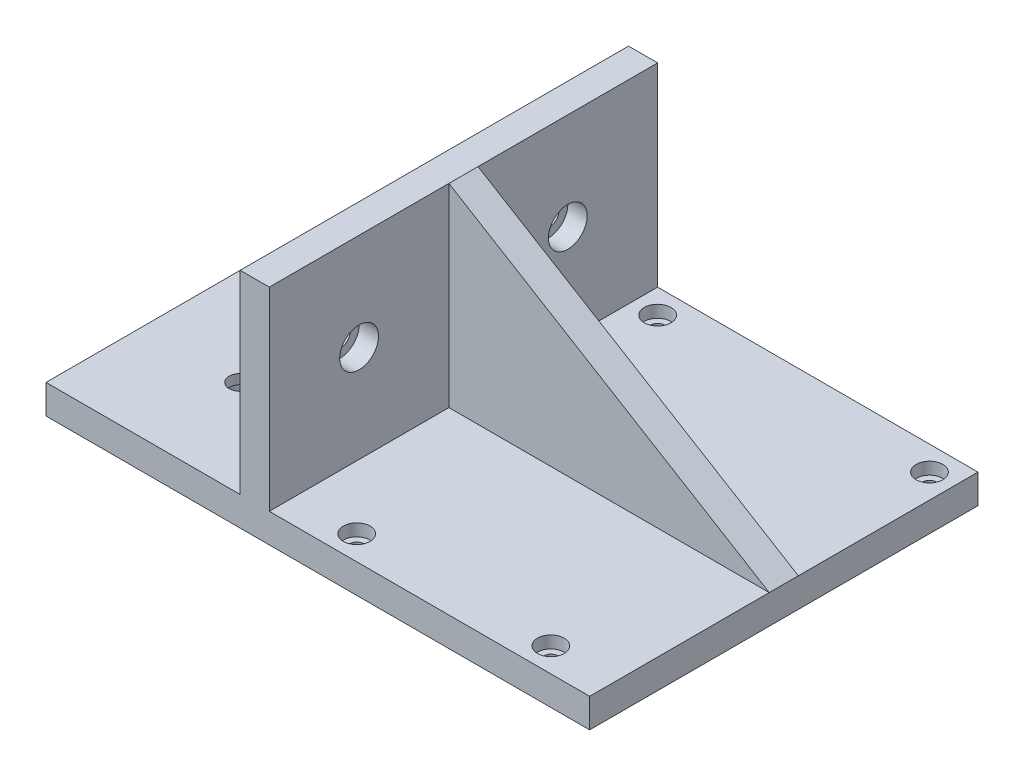
ISO-10303-21;
HEADER;
FILE_DESCRIPTION(('STEP AP214'),'2;1');
FILE_NAME('part.step','',(''),(''),'','','');
FILE_SCHEMA(('AUTOMOTIVE_DESIGN { 1 0 10303 214 1 1 1 1 }'));
ENDSEC;
DATA;
#1=APPLICATION_CONTEXT('core data for automotive mechanical design processes');
#2=APPLICATION_PROTOCOL_DEFINITION('international standard','automotive_design',2000,#1);
#3=PRODUCT_CONTEXT('',#1,'mechanical');
#4=PRODUCT('Part','Part','',(#3));
#5=PRODUCT_RELATED_PRODUCT_CATEGORY('part','',(#4));
#6=PRODUCT_DEFINITION_FORMATION('','',#4);
#7=PRODUCT_DEFINITION_CONTEXT('part definition',#1,'design');
#8=PRODUCT_DEFINITION('design','',#6,#7);
#9=PRODUCT_DEFINITION_SHAPE('','',#8);
#10=(LENGTH_UNIT() NAMED_UNIT(*) SI_UNIT(.MILLI.,.METRE.));
#11=(NAMED_UNIT(*) PLANE_ANGLE_UNIT() SI_UNIT($,.RADIAN.));
#12=(NAMED_UNIT(*) SI_UNIT($,.STERADIAN.) SOLID_ANGLE_UNIT());
#13=UNCERTAINTY_MEASURE_WITH_UNIT(LENGTH_MEASURE(1.E-05),#10,'distance_accuracy_value','');
#14=(GEOMETRIC_REPRESENTATION_CONTEXT(3) GLOBAL_UNCERTAINTY_ASSIGNED_CONTEXT((#13)) GLOBAL_UNIT_ASSIGNED_CONTEXT((#10,
#11,#12)) REPRESENTATION_CONTEXT('',''));
#15=CARTESIAN_POINT('',(0.,0.,0.));
#16=DIRECTION('',(0.,0.,1.));
#17=DIRECTION('',(1.,0.,0.));
#18=AXIS2_PLACEMENT_3D('',#15,#16,#17);
#19=CARTESIAN_POINT('',(0.,6.,0.));
#20=DIRECTION('',(0.,-1.,0.));
#21=DIRECTION('',(0.,0.,-1.));
#22=AXIS2_PLACEMENT_3D('',#19,#20,#21);
#23=PLANE('',#22);
#24=CARTESIAN_POINT('',(28.,6.,-35.));
#25=DIRECTION('',(0.,1.,0.));
#26=DIRECTION('',(0.,0.,1.));
#27=AXIS2_PLACEMENT_3D('',#24,#25,#26);
#28=CIRCLE('',#27,2.75);
#29=CARTESIAN_POINT('',(28.,6.,-32.25));
#30=VERTEX_POINT('',#29);
#31=EDGE_CURVE('E272',#30,#30,#28,.T.);
#32=ORIENTED_EDGE('',*,*,#31,.F.);
#33=EDGE_LOOP('',(#32));
#34=FACE_BOUND('',#33,.T.);
#35=CARTESIAN_POINT('',(-28.,6.,-35.));
#36=DIRECTION('',(0.,1.,0.));
#37=DIRECTION('',(0.,0.,1.));
#38=AXIS2_PLACEMENT_3D('',#35,#36,#37);
#39=CIRCLE('',#38,2.75);
#40=CARTESIAN_POINT('',(-28.,6.,-32.25));
#41=VERTEX_POINT('',#40);
#42=EDGE_CURVE('E251',#41,#41,#39,.T.);
#43=ORIENTED_EDGE('',*,*,#42,.F.);
#44=EDGE_LOOP('',(#43));
#45=FACE_BOUND('',#44,.T.);
#46=DIRECTION('',(-1.,0.,0.));
#47=VECTOR('',#46,1.);
#48=CARTESIAN_POINT('',(0.,6.,-3.));
#49=LINE('',#48,#47);
#50=CARTESIAN_POINT('',(33.,6.,-3.));
#51=VERTEX_POINT('',#50);
#52=CARTESIAN_POINT('',(-33.,6.,-3.));
#53=VERTEX_POINT('',#52);
#54=EDGE_CURVE('E85',#51,#53,#49,.T.);
#55=ORIENTED_EDGE('',*,*,#54,.F.);
#56=DIRECTION('',(0.,0.,-1.));
#57=VECTOR('',#56,1.);
#58=CARTESIAN_POINT('',(33.,6.,40.));
#59=LINE('',#58,#57);
#60=CARTESIAN_POINT('',(33.,6.,-40.));
#61=VERTEX_POINT('',#60);
#62=EDGE_CURVE('E325',#51,#61,#59,.T.);
#63=ORIENTED_EDGE('',*,*,#62,.T.);
#64=DIRECTION('',(-1.,0.,0.));
#65=VECTOR('',#64,1.);
#66=CARTESIAN_POINT('',(-33.,6.,-40.));
#67=LINE('',#66,#65);
#68=CARTESIAN_POINT('',(-33.,6.,-40.));
#69=VERTEX_POINT('',#68);
#70=EDGE_CURVE('E324',#61,#69,#67,.T.);
#71=ORIENTED_EDGE('',*,*,#70,.T.);
#72=DIRECTION('',(0.,0.,1.));
#73=VECTOR('',#72,1.);
#74=CARTESIAN_POINT('',(-33.,6.,40.));
#75=LINE('',#74,#73);
#76=EDGE_CURVE('E329',#69,#53,#75,.T.);
#77=ORIENTED_EDGE('',*,*,#76,.T.);
#78=EDGE_LOOP('',(#55,#63,#71,#77));
#79=FACE_BOUND('',#78,.T.);
#80=ADVANCED_FACE('F69',(#34,#45,#79),#23,.F.);
#81=CARTESIAN_POINT('',(-33.,0.,-86.3896540189728));
#82=DIRECTION('',(1.,0.,0.));
#83=DIRECTION('',(0.,0.,-1.));
#84=AXIS2_PLACEMENT_3D('',#81,#82,#83);
#85=PLANE('',#84);
#86=CARTESIAN_POINT('',(-33.,26.,-21.5));
#87=DIRECTION('',(1.,0.,0.));
#88=DIRECTION('',(0.,0.,-1.));
#89=AXIS2_PLACEMENT_3D('',#86,#87,#88);
#90=CIRCLE('',#89,4.);
#91=CARTESIAN_POINT('',(-33.,26.,-25.5));
#92=VERTEX_POINT('',#91);
#93=EDGE_CURVE('E498',#92,#92,#90,.T.);
#94=ORIENTED_EDGE('',*,*,#93,.F.);
#95=EDGE_LOOP('',(#94));
#96=FACE_BOUND('',#95,.T.);
#97=DIRECTION('',(0.,0.,1.));
#98=VECTOR('',#97,1.);
#99=CARTESIAN_POINT('',(-33.,46.,-86.3896540189728));
#100=LINE('',#99,#98);
#101=CARTESIAN_POINT('',(-33.,46.,-40.));
#102=VERTEX_POINT('',#101);
#103=CARTESIAN_POINT('',(-33.,46.,-3.));
#104=VERTEX_POINT('',#103);
#105=EDGE_CURVE('E169',#102,#104,#100,.T.);
#106=ORIENTED_EDGE('',*,*,#105,.T.);
#107=DIRECTION('',(0.,-1.,0.));
#108=VECTOR('',#107,1.);
#109=CARTESIAN_POINT('',(-33.,0.,-3.));
#110=LINE('',#109,#108);
#111=EDGE_CURVE('E191',#104,#53,#110,.T.);
#112=ORIENTED_EDGE('',*,*,#111,.T.);
#113=ORIENTED_EDGE('',*,*,#76,.F.);
#114=DIRECTION('',(0.,-1.,0.));
#115=VECTOR('',#114,1.);
#116=CARTESIAN_POINT('',(-33.,0.,-40.));
#117=LINE('',#116,#115);
#118=EDGE_CURVE('E207',#102,#69,#117,.T.);
#119=ORIENTED_EDGE('',*,*,#118,.F.);
#120=EDGE_LOOP('',(#106,#112,#113,#119));
#121=FACE_BOUND('',#120,.T.);
#122=ADVANCED_FACE('F364',(#96,#121),#85,.T.);
#123=CARTESIAN_POINT('',(33.,6.,40.));
#124=DIRECTION('',(-1.,0.,0.));
#125=DIRECTION('',(0.,0.,1.));
#126=AXIS2_PLACEMENT_3D('',#123,#124,#125);
#127=PLANE('',#126);
#128=DIRECTION('',(0.,0.,-1.));
#129=VECTOR('',#128,1.);
#130=CARTESIAN_POINT('',(33.,0.,40.));
#131=LINE('',#130,#129);
#132=CARTESIAN_POINT('',(33.,0.,40.));
#133=VERTEX_POINT('',#132);
#134=CARTESIAN_POINT('',(33.,0.,-40.));
#135=VERTEX_POINT('',#134);
#136=EDGE_CURVE('E320',#133,#135,#131,.T.);
#137=ORIENTED_EDGE('',*,*,#136,.T.);
#138=DIRECTION('',(0.,-1.,0.));
#139=VECTOR('',#138,1.);
#140=CARTESIAN_POINT('',(33.,6.,-40.));
#141=LINE('',#140,#139);
#142=EDGE_CURVE('E12',#61,#135,#141,.T.);
#143=ORIENTED_EDGE('',*,*,#142,.F.);
#144=ORIENTED_EDGE('',*,*,#62,.F.);
#145=DIRECTION('',(0.,0.,-1.));
#146=VECTOR('',#145,1.);
#147=CARTESIAN_POINT('',(33.,6.,0.));
#148=LINE('',#147,#146);
#149=CARTESIAN_POINT('',(33.,6.,3.));
#150=VERTEX_POINT('',#149);
#151=EDGE_CURVE('E92',#51,#150,#148,.F.);
#152=ORIENTED_EDGE('',*,*,#151,.T.);
#153=CARTESIAN_POINT('',(33.,6.,40.));
#154=VERTEX_POINT('',#153);
#155=EDGE_CURVE('E321',#154,#150,#59,.T.);
#156=ORIENTED_EDGE('',*,*,#155,.F.);
#157=DIRECTION('',(0.,-1.,0.));
#158=VECTOR('',#157,1.);
#159=CARTESIAN_POINT('',(33.,6.,40.));
#160=LINE('',#159,#158);
#161=EDGE_CURVE('E78',#154,#133,#160,.T.);
#162=ORIENTED_EDGE('',*,*,#161,.T.);
#163=EDGE_LOOP('',(#137,#143,#144,#152,#156,#162));
#164=FACE_BOUND('',#163,.T.);
#165=ADVANCED_FACE('F71',(#164),#127,.F.);
#166=CARTESIAN_POINT('',(-33.,6.,-40.));
#167=DIRECTION('',(0.,0.,1.));
#168=DIRECTION('',(1.,0.,0.));
#169=AXIS2_PLACEMENT_3D('',#166,#167,#168);
#170=PLANE('',#169);
#171=DIRECTION('',(-1.,0.,0.));
#172=VECTOR('',#171,1.);
#173=CARTESIAN_POINT('',(-33.,0.,-40.));
#174=LINE('',#173,#172);
#175=CARTESIAN_POINT('',(-79.,0.,-40.));
#176=VERTEX_POINT('',#175);
#177=EDGE_CURVE('E337',#135,#176,#174,.T.);
#178=ORIENTED_EDGE('',*,*,#177,.T.);
#179=DIRECTION('',(0.,-1.,0.));
#180=VECTOR('',#179,1.);
#181=CARTESIAN_POINT('',(-79.,0.,-40.));
#182=LINE('',#181,#180);
#183=CARTESIAN_POINT('',(-79.,5.99999999999999,-40.));
#184=VERTEX_POINT('',#183);
#185=EDGE_CURVE('E212',#184,#176,#182,.T.);
#186=ORIENTED_EDGE('',*,*,#185,.F.);
#187=DIRECTION('',(1.,0.,0.));
#188=VECTOR('',#187,1.);
#189=CARTESIAN_POINT('',(-33.,6.,-40.));
#190=LINE('',#189,#188);
#191=CARTESIAN_POINT('',(-39.,6.,-40.));
#192=VERTEX_POINT('',#191);
#193=EDGE_CURVE('E211',#184,#192,#190,.T.);
#194=ORIENTED_EDGE('',*,*,#193,.T.);
#195=DIRECTION('',(0.,-1.,0.));
#196=VECTOR('',#195,1.);
#197=CARTESIAN_POINT('',(-39.,6.,-40.));
#198=LINE('',#197,#196);
#199=CARTESIAN_POINT('',(-39.,46.,-40.));
#200=VERTEX_POINT('',#199);
#201=EDGE_CURVE('E241',#200,#192,#198,.T.);
#202=ORIENTED_EDGE('',*,*,#201,.F.);
#203=DIRECTION('',(1.,0.,0.));
#204=VECTOR('',#203,1.);
#205=CARTESIAN_POINT('',(-33.,46.,-40.));
#206=LINE('',#205,#204);
#207=EDGE_CURVE('E222',#200,#102,#206,.T.);
#208=ORIENTED_EDGE('',*,*,#207,.T.);
#209=ORIENTED_EDGE('',*,*,#118,.T.);
#210=ORIENTED_EDGE('',*,*,#70,.F.);
#211=ORIENTED_EDGE('',*,*,#142,.T.);
#212=EDGE_LOOP('',(#178,#186,#194,#202,#208,#209,#210,#211));
#213=FACE_BOUND('',#212,.T.);
#214=ADVANCED_FACE('F358',(#213),#170,.F.);
#215=CARTESIAN_POINT('',(-33.,6.,40.));
#216=DIRECTION('',(0.,0.,-1.));
#217=DIRECTION('',(-1.,0.,0.));
#218=AXIS2_PLACEMENT_3D('',#215,#216,#217);
#219=PLANE('',#218);
#220=DIRECTION('',(1.,0.,0.));
#221=VECTOR('',#220,1.);
#222=CARTESIAN_POINT('',(-33.,0.,40.));
#223=LINE('',#222,#221);
#224=CARTESIAN_POINT('',(-79.,0.,40.));
#225=VERTEX_POINT('',#224);
#226=EDGE_CURVE('E340',#225,#133,#223,.T.);
#227=ORIENTED_EDGE('',*,*,#226,.T.);
#228=ORIENTED_EDGE('',*,*,#161,.F.);
#229=DIRECTION('',(1.,0.,0.));
#230=VECTOR('',#229,1.);
#231=CARTESIAN_POINT('',(-33.,6.,40.));
#232=LINE('',#231,#230);
#233=CARTESIAN_POINT('',(-33.,6.,40.));
#234=VERTEX_POINT('',#233);
#235=EDGE_CURVE('E332',#234,#154,#232,.T.);
#236=ORIENTED_EDGE('',*,*,#235,.F.);
#237=DIRECTION('',(0.,1.,0.));
#238=VECTOR('',#237,1.);
#239=CARTESIAN_POINT('',(-33.,0.,40.));
#240=LINE('',#239,#238);
#241=CARTESIAN_POINT('',(-33.,46.,40.));
#242=VERTEX_POINT('',#241);
#243=EDGE_CURVE('E226',#234,#242,#240,.T.);
#244=ORIENTED_EDGE('',*,*,#243,.T.);
#245=DIRECTION('',(-1.,0.,0.));
#246=VECTOR('',#245,1.);
#247=CARTESIAN_POINT('',(-33.,46.,40.));
#248=LINE('',#247,#246);
#249=CARTESIAN_POINT('',(-39.,46.,40.));
#250=VERTEX_POINT('',#249);
#251=EDGE_CURVE('E162',#242,#250,#248,.T.);
#252=ORIENTED_EDGE('',*,*,#251,.T.);
#253=DIRECTION('',(0.,1.,0.));
#254=VECTOR('',#253,1.);
#255=CARTESIAN_POINT('',(-39.,6.,40.));
#256=LINE('',#255,#254);
#257=CARTESIAN_POINT('',(-39.,6.,40.));
#258=VERTEX_POINT('',#257);
#259=EDGE_CURVE('E244',#258,#250,#256,.T.);
#260=ORIENTED_EDGE('',*,*,#259,.F.);
#261=DIRECTION('',(-1.,0.,0.));
#262=VECTOR('',#261,1.);
#263=CARTESIAN_POINT('',(-33.,6.,40.));
#264=LINE('',#263,#262);
#265=CARTESIAN_POINT('',(-79.,5.99999999999999,40.));
#266=VERTEX_POINT('',#265);
#267=EDGE_CURVE('E217',#258,#266,#264,.T.);
#268=ORIENTED_EDGE('',*,*,#267,.T.);
#269=DIRECTION('',(0.,1.,0.));
#270=VECTOR('',#269,1.);
#271=CARTESIAN_POINT('',(-79.,0.,40.));
#272=LINE('',#271,#270);
#273=EDGE_CURVE('E221',#225,#266,#272,.T.);
#274=ORIENTED_EDGE('',*,*,#273,.F.);
#275=EDGE_LOOP('',(#227,#228,#236,#244,#252,#260,#268,#274));
#276=FACE_BOUND('',#275,.T.);
#277=ADVANCED_FACE('F381',(#276),#219,.F.);
#278=CARTESIAN_POINT('',(-20.,6.,35.));
#279=DIRECTION('',(0.,1.,0.));
#280=DIRECTION('',(0.,0.,1.));
#281=AXIS2_PLACEMENT_3D('',#278,#279,#280);
#282=CIRCLE('',#281,2.75);
#283=CARTESIAN_POINT('',(-20.,6.,37.75));
#284=VERTEX_POINT('',#283);
#285=EDGE_CURVE('E288',#284,#284,#282,.T.);
#286=ORIENTED_EDGE('',*,*,#285,.F.);
#287=EDGE_LOOP('',(#286));
#288=FACE_BOUND('',#287,.T.);
#289=CARTESIAN_POINT('',(20.,6.,35.));
#290=DIRECTION('',(0.,1.,0.));
#291=DIRECTION('',(0.,0.,1.));
#292=AXIS2_PLACEMENT_3D('',#289,#290,#291);
#293=CIRCLE('',#292,2.75);
#294=CARTESIAN_POINT('',(20.,6.,37.75));
#295=VERTEX_POINT('',#294);
#296=EDGE_CURVE('E304',#295,#295,#293,.T.);
#297=ORIENTED_EDGE('',*,*,#296,.F.);
#298=EDGE_LOOP('',(#297));
#299=FACE_BOUND('',#298,.T.);
#300=ORIENTED_EDGE('',*,*,#155,.T.);
#301=DIRECTION('',(-1.,0.,0.));
#302=VECTOR('',#301,1.);
#303=CARTESIAN_POINT('',(0.,6.,3.));
#304=LINE('',#303,#302);
#305=CARTESIAN_POINT('',(-33.,6.,3.));
#306=VERTEX_POINT('',#305);
#307=EDGE_CURVE('E179',#150,#306,#304,.T.);
#308=ORIENTED_EDGE('',*,*,#307,.T.);
#309=EDGE_CURVE('E174',#306,#234,#75,.T.);
#310=ORIENTED_EDGE('',*,*,#309,.T.);
#311=ORIENTED_EDGE('',*,*,#235,.T.);
#312=EDGE_LOOP('',(#300,#308,#310,#311));
#313=FACE_BOUND('',#312,.T.);
#314=ADVANCED_FACE('F368',(#288,#299,#313),#23,.F.);
#315=CARTESIAN_POINT('',(0.,0.,0.));
#316=DIRECTION('',(0.,-1.,0.));
#317=DIRECTION('',(0.,0.,-1.));
#318=AXIS2_PLACEMENT_3D('',#315,#316,#317);
#319=PLANE('',#318);
#320=CARTESIAN_POINT('',(-59.,0.,20.));
#321=DIRECTION('',(0.,-1.,0.));
#322=DIRECTION('',(0.,0.,-1.));
#323=AXIS2_PLACEMENT_3D('',#320,#321,#322);
#324=CIRCLE('',#323,4.);
#325=CARTESIAN_POINT('',(-59.,0.,16.));
#326=VERTEX_POINT('',#325);
#327=EDGE_CURVE('E467',#326,#326,#324,.T.);
#328=ORIENTED_EDGE('',*,*,#327,.F.);
#329=EDGE_LOOP('',(#328));
#330=FACE_BOUND('',#329,.T.);
#331=CARTESIAN_POINT('',(-59.,0.,-20.));
#332=DIRECTION('',(0.,-1.,0.));
#333=DIRECTION('',(0.,0.,-1.));
#334=AXIS2_PLACEMENT_3D('',#331,#332,#333);
#335=CIRCLE('',#334,4.);
#336=CARTESIAN_POINT('',(-59.,0.,-24.));
#337=VERTEX_POINT('',#336);
#338=EDGE_CURVE('E451',#337,#337,#335,.T.);
#339=ORIENTED_EDGE('',*,*,#338,.F.);
#340=EDGE_LOOP('',(#339));
#341=FACE_BOUND('',#340,.T.);
#342=ORIENTED_EDGE('',*,*,#226,.F.);
#343=DIRECTION('',(0.,0.,1.));
#344=VECTOR('',#343,1.);
#345=CARTESIAN_POINT('',(-79.,0.,-86.3896540189728));
#346=LINE('',#345,#344);
#347=EDGE_CURVE('E230',#176,#225,#346,.T.);
#348=ORIENTED_EDGE('',*,*,#347,.F.);
#349=ORIENTED_EDGE('',*,*,#177,.F.);
#350=ORIENTED_EDGE('',*,*,#136,.F.);
#351=EDGE_LOOP('',(#342,#348,#349,#350));
#352=FACE_BOUND('',#351,.T.);
#353=CARTESIAN_POINT('',(-20.,0.,35.));
#354=DIRECTION('',(0.,-1.,0.));
#355=DIRECTION('',(0.,0.,-1.));
#356=AXIS2_PLACEMENT_3D('',#353,#354,#355);
#357=CIRCLE('',#356,1.45);
#358=CARTESIAN_POINT('',(-20.,0.,33.55));
#359=VERTEX_POINT('',#358);
#360=EDGE_CURVE('E300',#359,#359,#357,.T.);
#361=ORIENTED_EDGE('',*,*,#360,.F.);
#362=EDGE_LOOP('',(#361));
#363=FACE_BOUND('',#362,.T.);
#364=CARTESIAN_POINT('',(20.,0.,35.));
#365=DIRECTION('',(0.,-1.,0.));
#366=DIRECTION('',(0.,0.,-1.));
#367=AXIS2_PLACEMENT_3D('',#364,#365,#366);
#368=CIRCLE('',#367,1.45);
#369=CARTESIAN_POINT('',(20.,0.,33.55));
#370=VERTEX_POINT('',#369);
#371=EDGE_CURVE('E316',#370,#370,#368,.T.);
#372=ORIENTED_EDGE('',*,*,#371,.F.);
#373=EDGE_LOOP('',(#372));
#374=FACE_BOUND('',#373,.T.);
#375=CARTESIAN_POINT('',(28.,0.,-35.));
#376=DIRECTION('',(0.,-1.,0.));
#377=DIRECTION('',(0.,0.,-1.));
#378=AXIS2_PLACEMENT_3D('',#375,#376,#377);
#379=CIRCLE('',#378,1.45);
#380=CARTESIAN_POINT('',(28.,0.,-36.45));
#381=VERTEX_POINT('',#380);
#382=EDGE_CURVE('E284',#381,#381,#379,.T.);
#383=ORIENTED_EDGE('',*,*,#382,.F.);
#384=EDGE_LOOP('',(#383));
#385=FACE_BOUND('',#384,.T.);
#386=CARTESIAN_POINT('',(-28.,0.,-35.));
#387=DIRECTION('',(0.,-1.,0.));
#388=DIRECTION('',(0.,0.,-1.));
#389=AXIS2_PLACEMENT_3D('',#386,#387,#388);
#390=CIRCLE('',#389,1.45);
#391=CARTESIAN_POINT('',(-28.,0.,-36.45));
#392=VERTEX_POINT('',#391);
#393=EDGE_CURVE('E268',#392,#392,#390,.T.);
#394=ORIENTED_EDGE('',*,*,#393,.F.);
#395=EDGE_LOOP('',(#394));
#396=FACE_BOUND('',#395,.T.);
#397=ADVANCED_FACE('F352',(#330,#341,#352,#363,#374,#385,#396),#319,.T.);
#398=CARTESIAN_POINT('',(20.,6.,35.));
#399=DIRECTION('',(0.,1.,0.));
#400=DIRECTION('',(0.,0.,1.));
#401=AXIS2_PLACEMENT_3D('',#398,#399,#400);
#402=CYLINDRICAL_SURFACE('',#401,1.45);
#403=CARTESIAN_POINT('',(20.,3.5,35.));
#404=DIRECTION('',(0.,1.,0.));
#405=DIRECTION('',(0.,0.,1.));
#406=AXIS2_PLACEMENT_3D('',#403,#404,#405);
#407=CIRCLE('',#406,1.45);
#408=CARTESIAN_POINT('',(20.,3.5,36.45));
#409=VERTEX_POINT('',#408);
#410=EDGE_CURVE('E312',#409,#409,#407,.T.);
#411=ORIENTED_EDGE('',*,*,#410,.T.);
#412=EDGE_LOOP('',(#411));
#413=FACE_BOUND('',#412,.T.);
#414=ORIENTED_EDGE('',*,*,#371,.T.);
#415=EDGE_LOOP('',(#414));
#416=FACE_BOUND('',#415,.T.);
#417=ADVANCED_FACE('F387',(#413,#416),#402,.F.);
#418=CARTESIAN_POINT('',(21.45,3.5,35.));
#419=DIRECTION('',(0.,-1.,0.));
#420=DIRECTION('',(0.,0.,-1.));
#421=AXIS2_PLACEMENT_3D('',#418,#419,#420);
#422=PLANE('',#421);
#423=ORIENTED_EDGE('',*,*,#410,.F.);
#424=EDGE_LOOP('',(#423));
#425=FACE_BOUND('',#424,.T.);
#426=CARTESIAN_POINT('',(20.,3.5,35.));
#427=DIRECTION('',(0.,1.,0.));
#428=DIRECTION('',(0.,0.,1.));
#429=AXIS2_PLACEMENT_3D('',#426,#427,#428);
#430=CIRCLE('',#429,2.75);
#431=CARTESIAN_POINT('',(20.,3.5,37.75));
#432=VERTEX_POINT('',#431);
#433=EDGE_CURVE('E308',#432,#432,#430,.T.);
#434=ORIENTED_EDGE('',*,*,#433,.T.);
#435=EDGE_LOOP('',(#434));
#436=FACE_BOUND('',#435,.T.);
#437=ADVANCED_FACE('F779',(#425,#436),#422,.F.);
#438=CARTESIAN_POINT('',(20.,6.,35.));
#439=DIRECTION('',(0.,1.,0.));
#440=DIRECTION('',(0.,0.,1.));
#441=AXIS2_PLACEMENT_3D('',#438,#439,#440);
#442=CYLINDRICAL_SURFACE('',#441,2.75);
#443=ORIENTED_EDGE('',*,*,#433,.F.);
#444=EDGE_LOOP('',(#443));
#445=FACE_BOUND('',#444,.T.);
#446=ORIENTED_EDGE('',*,*,#296,.T.);
#447=EDGE_LOOP('',(#446));
#448=FACE_BOUND('',#447,.T.);
#449=ADVANCED_FACE('F770',(#445,#448),#442,.F.);
#450=CARTESIAN_POINT('',(-20.,6.,35.));
#451=DIRECTION('',(0.,1.,0.));
#452=DIRECTION('',(0.,0.,1.));
#453=AXIS2_PLACEMENT_3D('',#450,#451,#452);
#454=CYLINDRICAL_SURFACE('',#453,1.45);
#455=CARTESIAN_POINT('',(-20.,3.5,35.));
#456=DIRECTION('',(0.,1.,0.));
#457=DIRECTION('',(0.,0.,1.));
#458=AXIS2_PLACEMENT_3D('',#455,#456,#457);
#459=CIRCLE('',#458,1.45);
#460=CARTESIAN_POINT('',(-20.,3.5,36.45));
#461=VERTEX_POINT('',#460);
#462=EDGE_CURVE('E296',#461,#461,#459,.T.);
#463=ORIENTED_EDGE('',*,*,#462,.T.);
#464=EDGE_LOOP('',(#463));
#465=FACE_BOUND('',#464,.T.);
#466=ORIENTED_EDGE('',*,*,#360,.T.);
#467=EDGE_LOOP('',(#466));
#468=FACE_BOUND('',#467,.T.);
#469=ADVANCED_FACE('F761',(#465,#468),#454,.F.);
#470=CARTESIAN_POINT('',(-18.55,3.5,35.));
#471=DIRECTION('',(0.,-1.,0.));
#472=DIRECTION('',(0.,0.,-1.));
#473=AXIS2_PLACEMENT_3D('',#470,#471,#472);
#474=PLANE('',#473);
#475=ORIENTED_EDGE('',*,*,#462,.F.);
#476=EDGE_LOOP('',(#475));
#477=FACE_BOUND('',#476,.T.);
#478=CARTESIAN_POINT('',(-20.,3.5,35.));
#479=DIRECTION('',(0.,1.,0.));
#480=DIRECTION('',(0.,0.,1.));
#481=AXIS2_PLACEMENT_3D('',#478,#479,#480);
#482=CIRCLE('',#481,2.75);
#483=CARTESIAN_POINT('',(-20.,3.5,37.75));
#484=VERTEX_POINT('',#483);
#485=EDGE_CURVE('E292',#484,#484,#482,.T.);
#486=ORIENTED_EDGE('',*,*,#485,.T.);
#487=EDGE_LOOP('',(#486));
#488=FACE_BOUND('',#487,.T.);
#489=ADVANCED_FACE('F752',(#477,#488),#474,.F.);
#490=CARTESIAN_POINT('',(-20.,6.,35.));
#491=DIRECTION('',(0.,1.,0.));
#492=DIRECTION('',(0.,0.,1.));
#493=AXIS2_PLACEMENT_3D('',#490,#491,#492);
#494=CYLINDRICAL_SURFACE('',#493,2.75);
#495=ORIENTED_EDGE('',*,*,#485,.F.);
#496=EDGE_LOOP('',(#495));
#497=FACE_BOUND('',#496,.T.);
#498=ORIENTED_EDGE('',*,*,#285,.T.);
#499=EDGE_LOOP('',(#498));
#500=FACE_BOUND('',#499,.T.);
#501=ADVANCED_FACE('F743',(#497,#500),#494,.F.);
#502=CARTESIAN_POINT('',(28.,6.,-35.));
#503=DIRECTION('',(0.,1.,0.));
#504=DIRECTION('',(0.,0.,1.));
#505=AXIS2_PLACEMENT_3D('',#502,#503,#504);
#506=CYLINDRICAL_SURFACE('',#505,1.45);
#507=CARTESIAN_POINT('',(28.,3.5,-35.));
#508=DIRECTION('',(0.,1.,0.));
#509=DIRECTION('',(0.,0.,1.));
#510=AXIS2_PLACEMENT_3D('',#507,#508,#509);
#511=CIRCLE('',#510,1.45);
#512=CARTESIAN_POINT('',(28.,3.5,-33.55));
#513=VERTEX_POINT('',#512);
#514=EDGE_CURVE('E280',#513,#513,#511,.T.);
#515=ORIENTED_EDGE('',*,*,#514,.T.);
#516=EDGE_LOOP('',(#515));
#517=FACE_BOUND('',#516,.T.);
#518=ORIENTED_EDGE('',*,*,#382,.T.);
#519=EDGE_LOOP('',(#518));
#520=FACE_BOUND('',#519,.T.);
#521=ADVANCED_FACE('F734',(#517,#520),#506,.F.);
#522=CARTESIAN_POINT('',(29.45,3.5,-35.));
#523=DIRECTION('',(0.,-1.,0.));
#524=DIRECTION('',(0.,0.,-1.));
#525=AXIS2_PLACEMENT_3D('',#522,#523,#524);
#526=PLANE('',#525);
#527=ORIENTED_EDGE('',*,*,#514,.F.);
#528=EDGE_LOOP('',(#527));
#529=FACE_BOUND('',#528,.T.);
#530=CARTESIAN_POINT('',(28.,3.5,-35.));
#531=DIRECTION('',(0.,1.,0.));
#532=DIRECTION('',(0.,0.,1.));
#533=AXIS2_PLACEMENT_3D('',#530,#531,#532);
#534=CIRCLE('',#533,2.75);
#535=CARTESIAN_POINT('',(28.,3.5,-32.25));
#536=VERTEX_POINT('',#535);
#537=EDGE_CURVE('E276',#536,#536,#534,.T.);
#538=ORIENTED_EDGE('',*,*,#537,.T.);
#539=EDGE_LOOP('',(#538));
#540=FACE_BOUND('',#539,.T.);
#541=ADVANCED_FACE('F725',(#529,#540),#526,.F.);
#542=CARTESIAN_POINT('',(28.,6.,-35.));
#543=DIRECTION('',(0.,1.,0.));
#544=DIRECTION('',(0.,0.,1.));
#545=AXIS2_PLACEMENT_3D('',#542,#543,#544);
#546=CYLINDRICAL_SURFACE('',#545,2.75);
#547=ORIENTED_EDGE('',*,*,#537,.F.);
#548=EDGE_LOOP('',(#547));
#549=FACE_BOUND('',#548,.T.);
#550=ORIENTED_EDGE('',*,*,#31,.T.);
#551=EDGE_LOOP('',(#550));
#552=FACE_BOUND('',#551,.T.);
#553=ADVANCED_FACE('F716',(#549,#552),#546,.F.);
#554=CARTESIAN_POINT('',(-28.,6.,-35.));
#555=DIRECTION('',(0.,1.,0.));
#556=DIRECTION('',(0.,0.,1.));
#557=AXIS2_PLACEMENT_3D('',#554,#555,#556);
#558=CYLINDRICAL_SURFACE('',#557,1.45);
#559=CARTESIAN_POINT('',(-28.,3.5,-35.));
#560=DIRECTION('',(0.,1.,0.));
#561=DIRECTION('',(0.,0.,1.));
#562=AXIS2_PLACEMENT_3D('',#559,#560,#561);
#563=CIRCLE('',#562,1.45);
#564=CARTESIAN_POINT('',(-28.,3.5,-33.55));
#565=VERTEX_POINT('',#564);
#566=EDGE_CURVE('E264',#565,#565,#563,.T.);
#567=ORIENTED_EDGE('',*,*,#566,.T.);
#568=EDGE_LOOP('',(#567));
#569=FACE_BOUND('',#568,.T.);
#570=ORIENTED_EDGE('',*,*,#393,.T.);
#571=EDGE_LOOP('',(#570));
#572=FACE_BOUND('',#571,.T.);
#573=ADVANCED_FACE('F707',(#569,#572),#558,.F.);
#574=CARTESIAN_POINT('',(-26.55,3.5,-35.));
#575=DIRECTION('',(0.,-1.,0.));
#576=DIRECTION('',(0.,0.,-1.));
#577=AXIS2_PLACEMENT_3D('',#574,#575,#576);
#578=PLANE('',#577);
#579=ORIENTED_EDGE('',*,*,#566,.F.);
#580=EDGE_LOOP('',(#579));
#581=FACE_BOUND('',#580,.T.);
#582=CARTESIAN_POINT('',(-28.,3.5,-35.));
#583=DIRECTION('',(0.,1.,0.));
#584=DIRECTION('',(0.,0.,1.));
#585=AXIS2_PLACEMENT_3D('',#582,#583,#584);
#586=CIRCLE('',#585,2.75);
#587=CARTESIAN_POINT('',(-28.,3.5,-32.25));
#588=VERTEX_POINT('',#587);
#589=EDGE_CURVE('E260',#588,#588,#586,.T.);
#590=ORIENTED_EDGE('',*,*,#589,.T.);
#591=EDGE_LOOP('',(#590));
#592=FACE_BOUND('',#591,.T.);
#593=ADVANCED_FACE('F427',(#581,#592),#578,.F.);
#594=CARTESIAN_POINT('',(-28.,6.,-35.));
#595=DIRECTION('',(0.,1.,0.));
#596=DIRECTION('',(0.,0.,1.));
#597=AXIS2_PLACEMENT_3D('',#594,#595,#596);
#598=CYLINDRICAL_SURFACE('',#597,2.75);
#599=ORIENTED_EDGE('',*,*,#589,.F.);
#600=EDGE_LOOP('',(#599));
#601=FACE_BOUND('',#600,.T.);
#602=ORIENTED_EDGE('',*,*,#42,.T.);
#603=EDGE_LOOP('',(#602));
#604=FACE_BOUND('',#603,.T.);
#605=ADVANCED_FACE('F421',(#601,#604),#598,.F.);
#606=CARTESIAN_POINT('',(-33.,26.,21.5));
#607=DIRECTION('',(1.,0.,0.));
#608=DIRECTION('',(0.,0.,-1.));
#609=AXIS2_PLACEMENT_3D('',#606,#607,#608);
#610=CIRCLE('',#609,4.);
#611=CARTESIAN_POINT('',(-33.,26.,17.5));
#612=VERTEX_POINT('',#611);
#613=EDGE_CURVE('E483',#612,#612,#610,.T.);
#614=ORIENTED_EDGE('',*,*,#613,.F.);
#615=EDGE_LOOP('',(#614));
#616=FACE_BOUND('',#615,.T.);
#617=DIRECTION('',(0.,-1.,0.));
#618=VECTOR('',#617,1.);
#619=CARTESIAN_POINT('',(-33.,0.,3.));
#620=LINE('',#619,#618);
#621=CARTESIAN_POINT('',(-33.,46.,3.));
#622=VERTEX_POINT('',#621);
#623=EDGE_CURVE('E172',#622,#306,#620,.T.);
#624=ORIENTED_EDGE('',*,*,#623,.F.);
#625=EDGE_CURVE('E154',#622,#242,#100,.T.);
#626=ORIENTED_EDGE('',*,*,#625,.T.);
#627=ORIENTED_EDGE('',*,*,#243,.F.);
#628=ORIENTED_EDGE('',*,*,#309,.F.);
#629=EDGE_LOOP('',(#624,#626,#627,#628));
#630=FACE_BOUND('',#629,.T.);
#631=ADVANCED_FACE('F173',(#616,#630),#85,.T.);
#632=CARTESIAN_POINT('',(-79.,0.,-86.3896540189728));
#633=DIRECTION('',(1.,0.,0.));
#634=DIRECTION('',(0.,0.,-1.));
#635=AXIS2_PLACEMENT_3D('',#632,#633,#634);
#636=PLANE('',#635);
#637=ORIENTED_EDGE('',*,*,#273,.T.);
#638=DIRECTION('',(0.,0.,1.));
#639=VECTOR('',#638,1.);
#640=CARTESIAN_POINT('',(-79.,5.99999999999999,-86.3896540189728));
#641=LINE('',#640,#639);
#642=EDGE_CURVE('E229',#184,#266,#641,.T.);
#643=ORIENTED_EDGE('',*,*,#642,.F.);
#644=ORIENTED_EDGE('',*,*,#185,.T.);
#645=ORIENTED_EDGE('',*,*,#347,.T.);
#646=EDGE_LOOP('',(#637,#643,#644,#645));
#647=FACE_BOUND('',#646,.T.);
#648=ADVANCED_FACE('F403',(#647),#636,.F.);
#649=CARTESIAN_POINT('',(-33.,6.,-86.3896540189728));
#650=DIRECTION('',(0.,1.,0.));
#651=DIRECTION('',(-1.,0.,0.));
#652=AXIS2_PLACEMENT_3D('',#649,#650,#651);
#653=PLANE('',#652);
#654=CARTESIAN_POINT('',(-59.,6.,20.));
#655=DIRECTION('',(0.,1.,0.));
#656=DIRECTION('',(-1.,0.,0.));
#657=AXIS2_PLACEMENT_3D('',#654,#655,#656);
#658=CIRCLE('',#657,2.25);
#659=CARTESIAN_POINT('',(-61.25,6.,20.));
#660=VERTEX_POINT('',#659);
#661=EDGE_CURVE('E438',#660,#660,#658,.T.);
#662=ORIENTED_EDGE('',*,*,#661,.F.);
#663=EDGE_LOOP('',(#662));
#664=FACE_BOUND('',#663,.T.);
#665=CARTESIAN_POINT('',(-59.,6.,-20.));
#666=DIRECTION('',(0.,1.,0.));
#667=DIRECTION('',(-1.,0.,0.));
#668=AXIS2_PLACEMENT_3D('',#665,#666,#667);
#669=CIRCLE('',#668,2.25);
#670=CARTESIAN_POINT('',(-61.25,6.,-20.));
#671=VERTEX_POINT('',#670);
#672=EDGE_CURVE('E196',#671,#671,#669,.T.);
#673=ORIENTED_EDGE('',*,*,#672,.F.);
#674=EDGE_LOOP('',(#673));
#675=FACE_BOUND('',#674,.T.);
#676=ORIENTED_EDGE('',*,*,#267,.F.);
#677=DIRECTION('',(0.,0.,1.));
#678=VECTOR('',#677,1.);
#679=CARTESIAN_POINT('',(-39.,6.,-86.3896540189728));
#680=LINE('',#679,#678);
#681=EDGE_CURVE('E216',#192,#258,#680,.T.);
#682=ORIENTED_EDGE('',*,*,#681,.F.);
#683=ORIENTED_EDGE('',*,*,#193,.F.);
#684=ORIENTED_EDGE('',*,*,#642,.T.);
#685=EDGE_LOOP('',(#676,#682,#683,#684));
#686=FACE_BOUND('',#685,.T.);
#687=ADVANCED_FACE('F399',(#664,#675,#686),#653,.T.);
#688=CARTESIAN_POINT('',(-33.,46.,-86.3896540189728));
#689=DIRECTION('',(0.,1.,0.));
#690=DIRECTION('',(0.,0.,1.));
#691=AXIS2_PLACEMENT_3D('',#688,#689,#690);
#692=PLANE('',#691);
#693=ORIENTED_EDGE('',*,*,#625,.F.);
#694=EDGE_CURVE('E159',#104,#622,#100,.T.);
#695=ORIENTED_EDGE('',*,*,#694,.F.);
#696=ORIENTED_EDGE('',*,*,#105,.F.);
#697=ORIENTED_EDGE('',*,*,#207,.F.);
#698=DIRECTION('',(0.,0.,1.));
#699=VECTOR('',#698,1.);
#700=CARTESIAN_POINT('',(-39.,46.,-86.3896540189728));
#701=LINE('',#700,#699);
#702=EDGE_CURVE('E167',#200,#250,#701,.T.);
#703=ORIENTED_EDGE('',*,*,#702,.T.);
#704=ORIENTED_EDGE('',*,*,#251,.F.);
#705=EDGE_LOOP('',(#693,#695,#696,#697,#703,#704));
#706=FACE_BOUND('',#705,.T.);
#707=ADVANCED_FACE('F156',(#706),#692,.T.);
#708=CARTESIAN_POINT('',(-39.,6.,-86.3896540189728));
#709=DIRECTION('',(1.,0.,0.));
#710=DIRECTION('',(0.,0.,-1.));
#711=AXIS2_PLACEMENT_3D('',#708,#709,#710);
#712=PLANE('',#711);
#713=CARTESIAN_POINT('',(-39.,26.,-21.5));
#714=DIRECTION('',(1.,0.,0.));
#715=DIRECTION('',(0.,0.,-1.));
#716=AXIS2_PLACEMENT_3D('',#713,#714,#715);
#717=CIRCLE('',#716,2.25);
#718=CARTESIAN_POINT('',(-39.,26.,-23.75));
#719=VERTEX_POINT('',#718);
#720=EDGE_CURVE('E487',#719,#719,#717,.T.);
#721=ORIENTED_EDGE('',*,*,#720,.T.);
#722=EDGE_LOOP('',(#721));
#723=FACE_BOUND('',#722,.T.);
#724=CARTESIAN_POINT('',(-39.,26.,21.5));
#725=DIRECTION('',(1.,0.,0.));
#726=DIRECTION('',(0.,0.,-1.));
#727=AXIS2_PLACEMENT_3D('',#724,#725,#726);
#728=CIRCLE('',#727,2.25);
#729=CARTESIAN_POINT('',(-39.,26.,19.25));
#730=VERTEX_POINT('',#729);
#731=EDGE_CURVE('E471',#730,#730,#728,.T.);
#732=ORIENTED_EDGE('',*,*,#731,.T.);
#733=EDGE_LOOP('',(#732));
#734=FACE_BOUND('',#733,.T.);
#735=ORIENTED_EDGE('',*,*,#259,.T.);
#736=ORIENTED_EDGE('',*,*,#702,.F.);
#737=ORIENTED_EDGE('',*,*,#201,.T.);
#738=ORIENTED_EDGE('',*,*,#681,.T.);
#739=EDGE_LOOP('',(#735,#736,#737,#738));
#740=FACE_BOUND('',#739,.T.);
#741=ADVANCED_FACE('F405',(#723,#734,#740),#712,.F.);
#742=CARTESIAN_POINT('',(-33.,46.,0.));
#743=DIRECTION('',(-0.518301716093344,-0.855197831554018,0.));
#744=DIRECTION('',(0.855197831554018,-0.518301716093344,0.));
#745=AXIS2_PLACEMENT_3D('',#742,#743,#744);
#746=PLANE('',#745);
#747=ORIENTED_EDGE('',*,*,#151,.F.);
#748=DIRECTION('',(0.855197831554018,-0.518301716093344,0.));
#749=VECTOR('',#748,1.);
#750=CARTESIAN_POINT('',(-33.,46.,-3.));
#751=LINE('',#750,#749);
#752=EDGE_CURVE('E187',#104,#51,#751,.T.);
#753=ORIENTED_EDGE('',*,*,#752,.F.);
#754=ORIENTED_EDGE('',*,*,#694,.T.);
#755=DIRECTION('',(0.855197831554018,-0.518301716093344,0.));
#756=VECTOR('',#755,1.);
#757=CARTESIAN_POINT('',(-33.,46.,3.));
#758=LINE('',#757,#756);
#759=EDGE_CURVE('E185',#622,#150,#758,.T.);
#760=ORIENTED_EDGE('',*,*,#759,.T.);
#761=EDGE_LOOP('',(#747,#753,#754,#760));
#762=FACE_BOUND('',#761,.T.);
#763=ADVANCED_FACE('F184',(#762),#746,.F.);
#764=CARTESIAN_POINT('',(-23.,23.,3.));
#765=DIRECTION('',(0.,0.,1.));
#766=DIRECTION('',(1.,0.,0.));
#767=AXIS2_PLACEMENT_3D('',#764,#765,#766);
#768=PLANE('',#767);
#769=ORIENTED_EDGE('',*,*,#307,.F.);
#770=ORIENTED_EDGE('',*,*,#759,.F.);
#771=ORIENTED_EDGE('',*,*,#623,.T.);
#772=EDGE_LOOP('',(#769,#770,#771));
#773=FACE_BOUND('',#772,.T.);
#774=ADVANCED_FACE('F189',(#773),#768,.T.);
#775=CARTESIAN_POINT('',(-23.,23.,-3.));
#776=DIRECTION('',(0.,0.,1.));
#777=DIRECTION('',(1.,0.,0.));
#778=AXIS2_PLACEMENT_3D('',#775,#776,#777);
#779=PLANE('',#778);
#780=ORIENTED_EDGE('',*,*,#752,.T.);
#781=ORIENTED_EDGE('',*,*,#54,.T.);
#782=ORIENTED_EDGE('',*,*,#111,.F.);
#783=EDGE_LOOP('',(#780,#781,#782));
#784=FACE_BOUND('',#783,.T.);
#785=ADVANCED_FACE('F362',(#784),#779,.F.);
#786=CARTESIAN_POINT('',(-59.,0.,-20.));
#787=DIRECTION('',(0.,-1.,0.));
#788=DIRECTION('',(0.,0.,-1.));
#789=AXIS2_PLACEMENT_3D('',#786,#787,#788);
#790=CYLINDRICAL_SURFACE('',#789,2.25);
#791=CARTESIAN_POINT('',(-59.,4.,-20.));
#792=DIRECTION('',(0.,-1.,0.));
#793=DIRECTION('',(0.,0.,-1.));
#794=AXIS2_PLACEMENT_3D('',#791,#792,#793);
#795=CIRCLE('',#794,2.25);
#796=CARTESIAN_POINT('',(-59.,4.,-22.25));
#797=VERTEX_POINT('',#796);
#798=EDGE_CURVE('E443',#797,#797,#795,.T.);
#799=ORIENTED_EDGE('',*,*,#798,.T.);
#800=EDGE_LOOP('',(#799));
#801=FACE_BOUND('',#800,.T.);
#802=ORIENTED_EDGE('',*,*,#672,.T.);
#803=EDGE_LOOP('',(#802));
#804=FACE_BOUND('',#803,.T.);
#805=ADVANCED_FACE('F550',(#801,#804),#790,.F.);
#806=CARTESIAN_POINT('',(-56.75,4.,-20.));
#807=DIRECTION('',(0.,1.,0.));
#808=DIRECTION('',(0.,0.,1.));
#809=AXIS2_PLACEMENT_3D('',#806,#807,#808);
#810=PLANE('',#809);
#811=ORIENTED_EDGE('',*,*,#798,.F.);
#812=EDGE_LOOP('',(#811));
#813=FACE_BOUND('',#812,.T.);
#814=CARTESIAN_POINT('',(-59.,4.,-20.));
#815=DIRECTION('',(0.,-1.,0.));
#816=DIRECTION('',(0.,0.,-1.));
#817=AXIS2_PLACEMENT_3D('',#814,#815,#816);
#818=CIRCLE('',#817,4.);
#819=CARTESIAN_POINT('',(-59.,4.,-24.));
#820=VERTEX_POINT('',#819);
#821=EDGE_CURVE('E446',#820,#820,#818,.T.);
#822=ORIENTED_EDGE('',*,*,#821,.T.);
#823=EDGE_LOOP('',(#822));
#824=FACE_BOUND('',#823,.T.);
#825=ADVANCED_FACE('F546',(#813,#824),#810,.F.);
#826=CARTESIAN_POINT('',(-59.,0.,-20.));
#827=DIRECTION('',(0.,-1.,0.));
#828=DIRECTION('',(0.,0.,-1.));
#829=AXIS2_PLACEMENT_3D('',#826,#827,#828);
#830=CYLINDRICAL_SURFACE('',#829,4.);
#831=ORIENTED_EDGE('',*,*,#821,.F.);
#832=EDGE_LOOP('',(#831));
#833=FACE_BOUND('',#832,.T.);
#834=ORIENTED_EDGE('',*,*,#338,.T.);
#835=EDGE_LOOP('',(#834));
#836=FACE_BOUND('',#835,.T.);
#837=ADVANCED_FACE('F542',(#833,#836),#830,.F.);
#838=CARTESIAN_POINT('',(-59.,0.,20.));
#839=DIRECTION('',(0.,-1.,0.));
#840=DIRECTION('',(0.,0.,-1.));
#841=AXIS2_PLACEMENT_3D('',#838,#839,#840);
#842=CYLINDRICAL_SURFACE('',#841,2.25);
#843=CARTESIAN_POINT('',(-59.,4.,20.));
#844=DIRECTION('',(0.,-1.,0.));
#845=DIRECTION('',(0.,0.,-1.));
#846=AXIS2_PLACEMENT_3D('',#843,#844,#845);
#847=CIRCLE('',#846,2.25);
#848=CARTESIAN_POINT('',(-59.,4.,17.75));
#849=VERTEX_POINT('',#848);
#850=EDGE_CURVE('E459',#849,#849,#847,.T.);
#851=ORIENTED_EDGE('',*,*,#850,.T.);
#852=EDGE_LOOP('',(#851));
#853=FACE_BOUND('',#852,.T.);
#854=ORIENTED_EDGE('',*,*,#661,.T.);
#855=EDGE_LOOP('',(#854));
#856=FACE_BOUND('',#855,.T.);
#857=ADVANCED_FACE('F538',(#853,#856),#842,.F.);
#858=CARTESIAN_POINT('',(-56.75,4.,20.));
#859=DIRECTION('',(0.,1.,0.));
#860=DIRECTION('',(0.,0.,1.));
#861=AXIS2_PLACEMENT_3D('',#858,#859,#860);
#862=PLANE('',#861);
#863=ORIENTED_EDGE('',*,*,#850,.F.);
#864=EDGE_LOOP('',(#863));
#865=FACE_BOUND('',#864,.T.);
#866=CARTESIAN_POINT('',(-59.,4.,20.));
#867=DIRECTION('',(0.,-1.,0.));
#868=DIRECTION('',(0.,0.,-1.));
#869=AXIS2_PLACEMENT_3D('',#866,#867,#868);
#870=CIRCLE('',#869,4.);
#871=CARTESIAN_POINT('',(-59.,4.,16.));
#872=VERTEX_POINT('',#871);
#873=EDGE_CURVE('E463',#872,#872,#870,.T.);
#874=ORIENTED_EDGE('',*,*,#873,.T.);
#875=EDGE_LOOP('',(#874));
#876=FACE_BOUND('',#875,.T.);
#877=ADVANCED_FACE('F534',(#865,#876),#862,.F.);
#878=CARTESIAN_POINT('',(-59.,0.,20.));
#879=DIRECTION('',(0.,-1.,0.));
#880=DIRECTION('',(0.,0.,-1.));
#881=AXIS2_PLACEMENT_3D('',#878,#879,#880);
#882=CYLINDRICAL_SURFACE('',#881,4.);
#883=ORIENTED_EDGE('',*,*,#873,.F.);
#884=EDGE_LOOP('',(#883));
#885=FACE_BOUND('',#884,.T.);
#886=ORIENTED_EDGE('',*,*,#327,.T.);
#887=EDGE_LOOP('',(#886));
#888=FACE_BOUND('',#887,.T.);
#889=ADVANCED_FACE('F530',(#885,#888),#882,.F.);
#890=CARTESIAN_POINT('',(-33.,26.,21.5));
#891=DIRECTION('',(1.,0.,0.));
#892=DIRECTION('',(0.,0.,-1.));
#893=AXIS2_PLACEMENT_3D('',#890,#891,#892);
#894=CYLINDRICAL_SURFACE('',#893,2.25);
#895=ORIENTED_EDGE('',*,*,#731,.F.);
#896=EDGE_LOOP('',(#895));
#897=FACE_BOUND('',#896,.T.);
#898=CARTESIAN_POINT('',(-37.,26.,21.5));
#899=DIRECTION('',(1.,0.,0.));
#900=DIRECTION('',(0.,0.,-1.));
#901=AXIS2_PLACEMENT_3D('',#898,#899,#900);
#902=CIRCLE('',#901,2.25);
#903=CARTESIAN_POINT('',(-37.,26.,19.25));
#904=VERTEX_POINT('',#903);
#905=EDGE_CURVE('E475',#904,#904,#902,.T.);
#906=ORIENTED_EDGE('',*,*,#905,.T.);
#907=EDGE_LOOP('',(#906));
#908=FACE_BOUND('',#907,.T.);
#909=ADVANCED_FACE('F526',(#897,#908),#894,.F.);
#910=CARTESIAN_POINT('',(-37.,28.25,21.5));
#911=DIRECTION('',(-1.,0.,0.));
#912=DIRECTION('',(0.,0.,1.));
#913=AXIS2_PLACEMENT_3D('',#910,#911,#912);
#914=PLANE('',#913);
#915=ORIENTED_EDGE('',*,*,#905,.F.);
#916=EDGE_LOOP('',(#915));
#917=FACE_BOUND('',#916,.T.);
#918=CARTESIAN_POINT('',(-37.,26.,21.5));
#919=DIRECTION('',(1.,0.,0.));
#920=DIRECTION('',(0.,0.,-1.));
#921=AXIS2_PLACEMENT_3D('',#918,#919,#920);
#922=CIRCLE('',#921,4.);
#923=CARTESIAN_POINT('',(-37.,26.,17.5));
#924=VERTEX_POINT('',#923);
#925=EDGE_CURVE('E479',#924,#924,#922,.T.);
#926=ORIENTED_EDGE('',*,*,#925,.T.);
#927=EDGE_LOOP('',(#926));
#928=FACE_BOUND('',#927,.T.);
#929=ADVANCED_FACE('F522',(#917,#928),#914,.F.);
#930=CARTESIAN_POINT('',(-33.,26.,21.5));
#931=DIRECTION('',(1.,0.,0.));
#932=DIRECTION('',(0.,0.,-1.));
#933=AXIS2_PLACEMENT_3D('',#930,#931,#932);
#934=CYLINDRICAL_SURFACE('',#933,4.);
#935=ORIENTED_EDGE('',*,*,#925,.F.);
#936=EDGE_LOOP('',(#935));
#937=FACE_BOUND('',#936,.T.);
#938=ORIENTED_EDGE('',*,*,#613,.T.);
#939=EDGE_LOOP('',(#938));
#940=FACE_BOUND('',#939,.T.);
#941=ADVANCED_FACE('F518',(#937,#940),#934,.F.);
#942=CARTESIAN_POINT('',(-33.,26.,-21.5));
#943=DIRECTION('',(1.,0.,0.));
#944=DIRECTION('',(0.,0.,-1.));
#945=AXIS2_PLACEMENT_3D('',#942,#943,#944);
#946=CYLINDRICAL_SURFACE('',#945,2.25);
#947=ORIENTED_EDGE('',*,*,#720,.F.);
#948=EDGE_LOOP('',(#947));
#949=FACE_BOUND('',#948,.T.);
#950=CARTESIAN_POINT('',(-37.,26.,-21.5));
#951=DIRECTION('',(1.,0.,0.));
#952=DIRECTION('',(0.,0.,-1.));
#953=AXIS2_PLACEMENT_3D('',#950,#951,#952);
#954=CIRCLE('',#953,2.25);
#955=CARTESIAN_POINT('',(-37.,26.,-23.75));
#956=VERTEX_POINT('',#955);
#957=EDGE_CURVE('E490',#956,#956,#954,.T.);
#958=ORIENTED_EDGE('',*,*,#957,.T.);
#959=EDGE_LOOP('',(#958));
#960=FACE_BOUND('',#959,.T.);
#961=ADVANCED_FACE('F511',(#949,#960),#946,.F.);
#962=CARTESIAN_POINT('',(-37.,28.25,-21.5));
#963=DIRECTION('',(-1.,0.,0.));
#964=DIRECTION('',(0.,0.,1.));
#965=AXIS2_PLACEMENT_3D('',#962,#963,#964);
#966=PLANE('',#965);
#967=ORIENTED_EDGE('',*,*,#957,.F.);
#968=EDGE_LOOP('',(#967));
#969=FACE_BOUND('',#968,.T.);
#970=CARTESIAN_POINT('',(-37.,26.,-21.5));
#971=DIRECTION('',(1.,0.,0.));
#972=DIRECTION('',(0.,0.,-1.));
#973=AXIS2_PLACEMENT_3D('',#970,#971,#972);
#974=CIRCLE('',#973,4.);
#975=CARTESIAN_POINT('',(-37.,26.,-25.5));
#976=VERTEX_POINT('',#975);
#977=EDGE_CURVE('E494',#976,#976,#974,.T.);
#978=ORIENTED_EDGE('',*,*,#977,.T.);
#979=EDGE_LOOP('',(#978));
#980=FACE_BOUND('',#979,.T.);
#981=ADVANCED_FACE('F505',(#969,#980),#966,.F.);
#982=CARTESIAN_POINT('',(-33.,26.,-21.5));
#983=DIRECTION('',(1.,0.,0.));
#984=DIRECTION('',(0.,0.,-1.));
#985=AXIS2_PLACEMENT_3D('',#982,#983,#984);
#986=CYLINDRICAL_SURFACE('',#985,4.);
#987=ORIENTED_EDGE('',*,*,#977,.F.);
#988=EDGE_LOOP('',(#987));
#989=FACE_BOUND('',#988,.T.);
#990=ORIENTED_EDGE('',*,*,#93,.T.);
#991=EDGE_LOOP('',(#990));
#992=FACE_BOUND('',#991,.T.);
#993=ADVANCED_FACE('F503',(#989,#992),#986,.F.);
#994=CLOSED_SHELL('',(#80,#122,#165,#214,#277,#314,#397,#417,#437,#449,#469,#489,#501,#521,#541,
#553,#573,#593,#605,#631,#648,#687,#707,#741,#763,#774,#785,#805,#825,#837,#857,#877,#889,#909,
#929,#941,#961,#981,#993));
#995=MANIFOLD_SOLID_BREP('B2',#994);
#996=ADVANCED_BREP_SHAPE_REPRESENTATION('',(#18,#995),#14);
#997=SHAPE_DEFINITION_REPRESENTATION(#9,#996);
ENDSEC;
END-ISO-10303-21;
